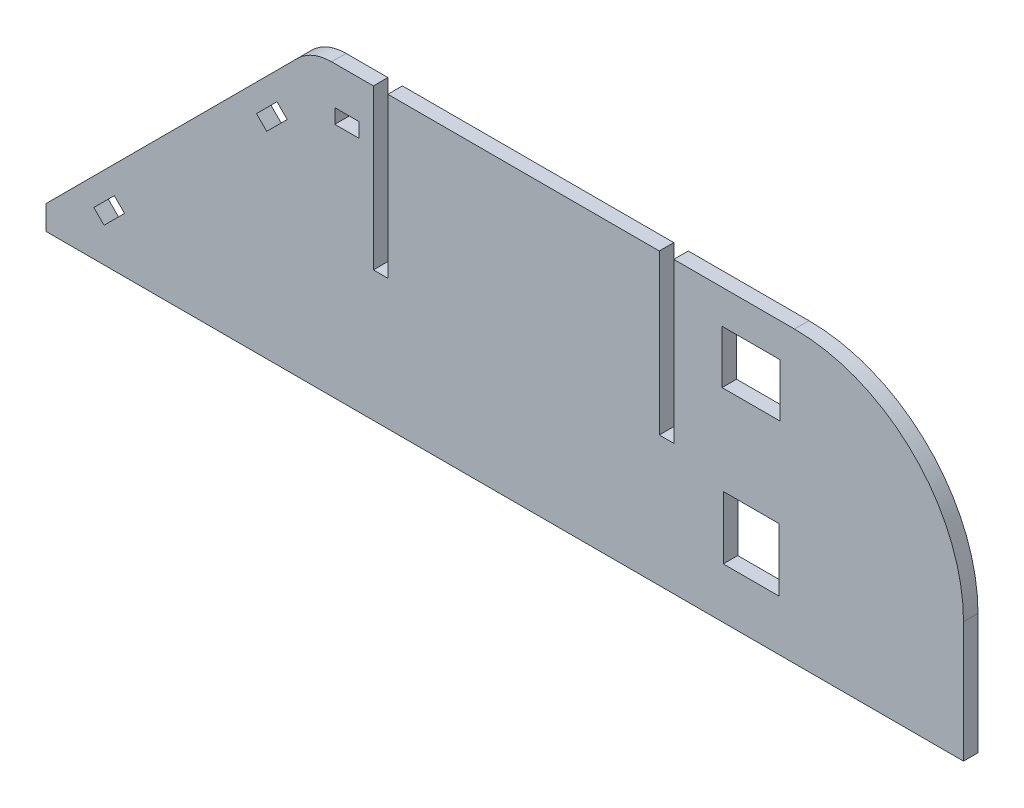
ISO-10303-21;
HEADER;
FILE_DESCRIPTION(('STEP AP214'),'2;1');
FILE_NAME('part.step','',(''),(''),'','','');
FILE_SCHEMA(('AUTOMOTIVE_DESIGN { 1 0 10303 214 1 1 1 1 }'));
ENDSEC;
DATA;
#1=APPLICATION_CONTEXT('core data for automotive mechanical design processes');
#2=APPLICATION_PROTOCOL_DEFINITION('international standard','automotive_design',2000,#1);
#3=PRODUCT_CONTEXT('',#1,'mechanical');
#4=PRODUCT('Part','Part','',(#3));
#5=PRODUCT_RELATED_PRODUCT_CATEGORY('part','',(#4));
#6=PRODUCT_DEFINITION_FORMATION('','',#4);
#7=PRODUCT_DEFINITION_CONTEXT('part definition',#1,'design');
#8=PRODUCT_DEFINITION('design','',#6,#7);
#9=PRODUCT_DEFINITION_SHAPE('','',#8);
#10=(LENGTH_UNIT() NAMED_UNIT(*) SI_UNIT(.MILLI.,.METRE.));
#11=(NAMED_UNIT(*) PLANE_ANGLE_UNIT() SI_UNIT($,.RADIAN.));
#12=(NAMED_UNIT(*) SI_UNIT($,.STERADIAN.) SOLID_ANGLE_UNIT());
#13=UNCERTAINTY_MEASURE_WITH_UNIT(LENGTH_MEASURE(1.E-05),#10,'distance_accuracy_value','');
#14=(GEOMETRIC_REPRESENTATION_CONTEXT(3) GLOBAL_UNCERTAINTY_ASSIGNED_CONTEXT((#13)) GLOBAL_UNIT_ASSIGNED_CONTEXT((#10,
#11,#12)) REPRESENTATION_CONTEXT('',''));
#15=CARTESIAN_POINT('',(0.,0.,0.));
#16=DIRECTION('',(0.,0.,1.));
#17=DIRECTION('',(1.,0.,0.));
#18=AXIS2_PLACEMENT_3D('',#15,#16,#17);
#19=CARTESIAN_POINT('',(0.,30.,3.));
#20=DIRECTION('',(0.,1.,0.));
#21=DIRECTION('',(-1.,0.,0.));
#22=AXIS2_PLACEMENT_3D('',#19,#20,#21);
#23=PLANE('',#22);
#24=DIRECTION('',(1.,0.,0.));
#25=VECTOR('',#24,1.);
#26=CARTESIAN_POINT('',(0.,30.,0.));
#27=LINE('',#26,#25);
#28=CARTESIAN_POINT('',(-35.857864376269,30.,0.));
#29=VERTEX_POINT('',#28);
#30=CARTESIAN_POINT('',(-27.2,30.,0.));
#31=VERTEX_POINT('',#30);
#32=EDGE_CURVE('E496',#29,#31,#27,.T.);
#33=ORIENTED_EDGE('',*,*,#32,.F.);
#34=DIRECTION('',(0.,0.,-1.));
#35=VECTOR('',#34,1.);
#36=CARTESIAN_POINT('',(-35.857864376269,30.,3.));
#37=LINE('',#36,#35);
#38=CARTESIAN_POINT('',(-35.857864376269,30.,3.));
#39=VERTEX_POINT('',#38);
#40=EDGE_CURVE('E45',#29,#39,#37,.F.);
#41=ORIENTED_EDGE('',*,*,#40,.T.);
#42=DIRECTION('',(1.,0.,0.));
#43=VECTOR('',#42,1.);
#44=CARTESIAN_POINT('',(0.,30.,3.));
#45=LINE('',#44,#43);
#46=CARTESIAN_POINT('',(-27.2,30.,3.));
#47=VERTEX_POINT('',#46);
#48=EDGE_CURVE('E482',#39,#47,#45,.T.);
#49=ORIENTED_EDGE('',*,*,#48,.T.);
#50=DIRECTION('',(0.,0.,1.));
#51=VECTOR('',#50,1.);
#52=CARTESIAN_POINT('',(-27.2,30.,0.));
#53=LINE('',#52,#51);
#54=EDGE_CURVE('E445',#31,#47,#53,.T.);
#55=ORIENTED_EDGE('',*,*,#54,.F.);
#56=EDGE_LOOP('',(#33,#41,#49,#55));
#57=FACE_BOUND('',#56,.T.);
#58=ADVANCED_FACE('F37',(#57),#23,.T.);
#59=DIRECTION('',(0.,0.,1.));
#60=VECTOR('',#59,1.);
#61=CARTESIAN_POINT('',(35.,30.,0.));
#62=LINE('',#61,#60);
#63=CARTESIAN_POINT('',(35.,30.,0.));
#64=VERTEX_POINT('',#63);
#65=CARTESIAN_POINT('',(35.,30.,3.));
#66=VERTEX_POINT('',#65);
#67=EDGE_CURVE('E465',#64,#66,#62,.T.);
#68=ORIENTED_EDGE('',*,*,#67,.T.);
#69=CARTESIAN_POINT('',(60.,30.,3.));
#70=VERTEX_POINT('',#69);
#71=EDGE_CURVE('E486',#66,#70,#45,.T.);
#72=ORIENTED_EDGE('',*,*,#71,.T.);
#73=DIRECTION('',(0.,0.,-1.));
#74=VECTOR('',#73,1.);
#75=CARTESIAN_POINT('',(60.,30.,3.));
#76=LINE('',#75,#74);
#77=CARTESIAN_POINT('',(60.,30.,0.));
#78=VERTEX_POINT('',#77);
#79=EDGE_CURVE('E516',#70,#78,#76,.T.);
#80=ORIENTED_EDGE('',*,*,#79,.T.);
#81=EDGE_CURVE('E474',#64,#78,#27,.T.);
#82=ORIENTED_EDGE('',*,*,#81,.F.);
#83=EDGE_LOOP('',(#68,#72,#80,#82));
#84=FACE_BOUND('',#83,.T.);
#85=ADVANCED_FACE('F569',(#84),#23,.T.);
#86=DIRECTION('',(0.,0.,1.));
#87=VECTOR('',#86,1.);
#88=CARTESIAN_POINT('',(-24.2,30.,0.));
#89=LINE('',#88,#87);
#90=CARTESIAN_POINT('',(-24.2,30.,0.));
#91=VERTEX_POINT('',#90);
#92=CARTESIAN_POINT('',(-24.2,30.,3.));
#93=VERTEX_POINT('',#92);
#94=EDGE_CURVE('E449',#91,#93,#89,.T.);
#95=ORIENTED_EDGE('',*,*,#94,.T.);
#96=CARTESIAN_POINT('',(32.,30.,3.));
#97=VERTEX_POINT('',#96);
#98=EDGE_CURVE('E485',#93,#97,#45,.T.);
#99=ORIENTED_EDGE('',*,*,#98,.T.);
#100=DIRECTION('',(0.,0.,1.));
#101=VECTOR('',#100,1.);
#102=CARTESIAN_POINT('',(32.,30.,0.));
#103=LINE('',#102,#101);
#104=CARTESIAN_POINT('',(32.,30.,0.));
#105=VERTEX_POINT('',#104);
#106=EDGE_CURVE('E477',#105,#97,#103,.T.);
#107=ORIENTED_EDGE('',*,*,#106,.F.);
#108=EDGE_CURVE('E499',#91,#105,#27,.T.);
#109=ORIENTED_EDGE('',*,*,#108,.F.);
#110=EDGE_LOOP('',(#95,#99,#107,#109));
#111=FACE_BOUND('',#110,.T.);
#112=ADVANCED_FACE('F574',(#111),#23,.T.);
#113=CARTESIAN_POINT('',(-35.,35.,3.));
#114=DIRECTION('',(0.707106781186547,-0.707106781186547,0.));
#115=DIRECTION('',(0.707106781186548,0.707106781186548,0.));
#116=AXIS2_PLACEMENT_3D('',#113,#114,#115);
#117=PLANE('',#116);
#118=DIRECTION('',(-0.707106781186548,-0.707106781186548,0.));
#119=VECTOR('',#118,1.);
#120=CARTESIAN_POINT('',(-35.,35.,3.));
#121=LINE('',#120,#119);
#122=CARTESIAN_POINT('',(-42.9289321881345,27.0710678118655,3.));
#123=VERTEX_POINT('',#122);
#124=CARTESIAN_POINT('',(-95.,-25.,3.));
#125=VERTEX_POINT('',#124);
#126=EDGE_CURVE('E484',#123,#125,#121,.T.);
#127=ORIENTED_EDGE('',*,*,#126,.F.);
#128=DIRECTION('',(0.,0.,-1.));
#129=VECTOR('',#128,1.);
#130=CARTESIAN_POINT('',(-42.9289321881345,27.0710678118655,0.));
#131=LINE('',#130,#129);
#132=CARTESIAN_POINT('',(-42.9289321881345,27.0710678118655,0.));
#133=VERTEX_POINT('',#132);
#134=EDGE_CURVE('E526',#123,#133,#131,.T.);
#135=ORIENTED_EDGE('',*,*,#134,.T.);
#136=DIRECTION('',(-0.707106781186548,-0.707106781186548,0.));
#137=VECTOR('',#136,1.);
#138=CARTESIAN_POINT('',(-35.,35.,0.));
#139=LINE('',#138,#137);
#140=CARTESIAN_POINT('',(-95.,-25.,0.));
#141=VERTEX_POINT('',#140);
#142=EDGE_CURVE('E498',#133,#141,#139,.T.);
#143=ORIENTED_EDGE('',*,*,#142,.T.);
#144=DIRECTION('',(0.,0.,-1.));
#145=VECTOR('',#144,1.);
#146=CARTESIAN_POINT('',(-95.,-25.,3.));
#147=LINE('',#146,#145);
#148=EDGE_CURVE('E513',#125,#141,#147,.T.);
#149=ORIENTED_EDGE('',*,*,#148,.F.);
#150=EDGE_LOOP('',(#127,#135,#143,#149));
#151=FACE_BOUND('',#150,.T.);
#152=ADVANCED_FACE('F544',(#151),#117,.F.);
#153=CARTESIAN_POINT('',(-95.,0.,3.));
#154=DIRECTION('',(1.,0.,0.));
#155=DIRECTION('',(0.,0.,-1.));
#156=AXIS2_PLACEMENT_3D('',#153,#154,#155);
#157=PLANE('',#156);
#158=DIRECTION('',(0.,-1.,0.));
#159=VECTOR('',#158,1.);
#160=CARTESIAN_POINT('',(-95.,0.,0.));
#161=LINE('',#160,#159);
#162=CARTESIAN_POINT('',(-95.,-30.,0.));
#163=VERTEX_POINT('',#162);
#164=EDGE_CURVE('E501',#141,#163,#161,.T.);
#165=ORIENTED_EDGE('',*,*,#164,.T.);
#166=DIRECTION('',(0.,0.,-1.));
#167=VECTOR('',#166,1.);
#168=CARTESIAN_POINT('',(-95.,-30.,3.));
#169=LINE('',#168,#167);
#170=CARTESIAN_POINT('',(-95.,-30.,3.));
#171=VERTEX_POINT('',#170);
#172=EDGE_CURVE('E510',#171,#163,#169,.T.);
#173=ORIENTED_EDGE('',*,*,#172,.F.);
#174=DIRECTION('',(0.,-1.,0.));
#175=VECTOR('',#174,1.);
#176=CARTESIAN_POINT('',(-95.,0.,3.));
#177=LINE('',#176,#175);
#178=EDGE_CURVE('E488',#125,#171,#177,.T.);
#179=ORIENTED_EDGE('',*,*,#178,.F.);
#180=ORIENTED_EDGE('',*,*,#148,.T.);
#181=EDGE_LOOP('',(#165,#173,#179,#180));
#182=FACE_BOUND('',#181,.T.);
#183=ADVANCED_FACE('F552',(#182),#157,.F.);
#184=CARTESIAN_POINT('',(0.,-30.,3.));
#185=DIRECTION('',(0.,1.,0.));
#186=DIRECTION('',(-1.,0.,0.));
#187=AXIS2_PLACEMENT_3D('',#184,#185,#186);
#188=PLANE('',#187);
#189=DIRECTION('',(1.,0.,0.));
#190=VECTOR('',#189,1.);
#191=CARTESIAN_POINT('',(0.,-30.,0.));
#192=LINE('',#191,#190);
#193=CARTESIAN_POINT('',(95.,-30.,0.));
#194=VERTEX_POINT('',#193);
#195=EDGE_CURVE('E503',#163,#194,#192,.T.);
#196=ORIENTED_EDGE('',*,*,#195,.T.);
#197=DIRECTION('',(0.,0.,-1.));
#198=VECTOR('',#197,1.);
#199=CARTESIAN_POINT('',(95.,-30.,3.));
#200=LINE('',#199,#198);
#201=CARTESIAN_POINT('',(95.,-30.,3.));
#202=VERTEX_POINT('',#201);
#203=EDGE_CURVE('E495',#202,#194,#200,.T.);
#204=ORIENTED_EDGE('',*,*,#203,.F.);
#205=DIRECTION('',(1.,0.,0.));
#206=VECTOR('',#205,1.);
#207=CARTESIAN_POINT('',(0.,-30.,3.));
#208=LINE('',#207,#206);
#209=EDGE_CURVE('E490',#171,#202,#208,.T.);
#210=ORIENTED_EDGE('',*,*,#209,.F.);
#211=ORIENTED_EDGE('',*,*,#172,.T.);
#212=EDGE_LOOP('',(#196,#204,#210,#211));
#213=FACE_BOUND('',#212,.T.);
#214=ADVANCED_FACE('F556',(#213),#188,.F.);
#215=CARTESIAN_POINT('',(95.,0.,3.));
#216=DIRECTION('',(1.,0.,0.));
#217=DIRECTION('',(0.,1.,0.));
#218=AXIS2_PLACEMENT_3D('',#215,#216,#217);
#219=PLANE('',#218);
#220=DIRECTION('',(0.,-1.,0.));
#221=VECTOR('',#220,1.);
#222=CARTESIAN_POINT('',(95.,0.,0.));
#223=LINE('',#222,#221);
#224=CARTESIAN_POINT('',(95.,-4.99999999999998,0.));
#225=VERTEX_POINT('',#224);
#226=EDGE_CURVE('E506',#225,#194,#223,.T.);
#227=ORIENTED_EDGE('',*,*,#226,.F.);
#228=DIRECTION('',(0.,0.,-1.));
#229=VECTOR('',#228,1.);
#230=CARTESIAN_POINT('',(95.,-4.99999999999998,3.));
#231=LINE('',#230,#229);
#232=CARTESIAN_POINT('',(95.,-4.99999999999998,3.));
#233=VERTEX_POINT('',#232);
#234=EDGE_CURVE('E521',#225,#233,#231,.F.);
#235=ORIENTED_EDGE('',*,*,#234,.T.);
#236=DIRECTION('',(0.,-1.,0.));
#237=VECTOR('',#236,1.);
#238=CARTESIAN_POINT('',(95.,0.,3.));
#239=LINE('',#238,#237);
#240=EDGE_CURVE('E493',#233,#202,#239,.T.);
#241=ORIENTED_EDGE('',*,*,#240,.T.);
#242=ORIENTED_EDGE('',*,*,#203,.T.);
#243=EDGE_LOOP('',(#227,#235,#241,#242));
#244=FACE_BOUND('',#243,.T.);
#245=ADVANCED_FACE('F618',(#244),#219,.T.);
#246=CARTESIAN_POINT('',(0.,0.,3.));
#247=DIRECTION('',(0.,0.,1.));
#248=DIRECTION('',(1.,0.,0.));
#249=AXIS2_PLACEMENT_3D('',#246,#247,#248);
#250=PLANE('',#249);
#251=DIRECTION('',(0.,-1.,0.));
#252=VECTOR('',#251,1.);
#253=CARTESIAN_POINT('',(-30.2,22.11,3.));
#254=LINE('',#253,#252);
#255=CARTESIAN_POINT('',(-30.2,22.11,3.));
#256=VERTEX_POINT('',#255);
#257=CARTESIAN_POINT('',(-30.2,19.11,3.));
#258=VERTEX_POINT('',#257);
#259=EDGE_CURVE('E265',#256,#258,#254,.T.);
#260=ORIENTED_EDGE('',*,*,#259,.T.);
#261=DIRECTION('',(-1.,0.,0.));
#262=VECTOR('',#261,1.);
#263=CARTESIAN_POINT('',(-30.2,19.11,3.));
#264=LINE('',#263,#262);
#265=CARTESIAN_POINT('',(-35.2,19.11,3.));
#266=VERTEX_POINT('',#265);
#267=EDGE_CURVE('E274',#258,#266,#264,.T.);
#268=ORIENTED_EDGE('',*,*,#267,.T.);
#269=DIRECTION('',(0.,1.,0.));
#270=VECTOR('',#269,1.);
#271=CARTESIAN_POINT('',(-35.2,22.11,3.));
#272=LINE('',#271,#270);
#273=CARTESIAN_POINT('',(-35.2,22.11,3.));
#274=VERTEX_POINT('',#273);
#275=EDGE_CURVE('E52',#266,#274,#272,.T.);
#276=ORIENTED_EDGE('',*,*,#275,.T.);
#277=DIRECTION('',(1.,0.,0.));
#278=VECTOR('',#277,1.);
#279=CARTESIAN_POINT('',(-30.2,22.11,3.));
#280=LINE('',#279,#278);
#281=EDGE_CURVE('E271',#274,#256,#280,.T.);
#282=ORIENTED_EDGE('',*,*,#281,.T.);
#283=EDGE_LOOP('',(#260,#268,#276,#282));
#284=FACE_BOUND('',#283,.T.);
#285=DIRECTION('',(0.707106781186548,0.707106781186548,0.));
#286=VECTOR('',#285,1.);
#287=CARTESIAN_POINT('',(-80.8578643762691,-16.5147186257614,3.));
#288=LINE('',#287,#286);
#289=CARTESIAN_POINT('',(-85.1005050633884,-20.7573593128807,3.));
#290=VERTEX_POINT('',#289);
#291=CARTESIAN_POINT('',(-80.8578643762691,-16.5147186257614,3.));
#292=VERTEX_POINT('',#291);
#293=EDGE_CURVE('E300',#290,#292,#288,.T.);
#294=ORIENTED_EDGE('',*,*,#293,.T.);
#295=DIRECTION('',(0.707106781186551,-0.707106781186544,0.));
#296=VECTOR('',#295,1.);
#297=CARTESIAN_POINT('',(-78.7365440327094,-18.6360389693211,3.));
#298=LINE('',#297,#296);
#299=CARTESIAN_POINT('',(-78.7365440327094,-18.6360389693211,3.));
#300=VERTEX_POINT('',#299);
#301=EDGE_CURVE('E303',#292,#300,#298,.T.);
#302=ORIENTED_EDGE('',*,*,#301,.T.);
#303=DIRECTION('',(-0.707106781186548,-0.707106781186547,0.));
#304=VECTOR('',#303,1.);
#305=CARTESIAN_POINT('',(-82.9791847198287,-22.8786796564404,3.));
#306=LINE('',#305,#304);
#307=CARTESIAN_POINT('',(-82.9791847198287,-22.8786796564404,3.));
#308=VERTEX_POINT('',#307);
#309=EDGE_CURVE('E307',#300,#308,#306,.T.);
#310=ORIENTED_EDGE('',*,*,#309,.T.);
#311=DIRECTION('',(-0.707106781186547,0.707106781186547,0.));
#312=VECTOR('',#311,1.);
#313=CARTESIAN_POINT('',(-85.1005050633884,-20.7573593128807,3.));
#314=LINE('',#313,#312);
#315=EDGE_CURVE('E310',#308,#290,#314,.T.);
#316=ORIENTED_EDGE('',*,*,#315,.T.);
#317=EDGE_LOOP('',(#294,#302,#310,#316));
#318=FACE_BOUND('',#317,.T.);
#319=DIRECTION('',(0.707106781186548,0.707106781186548,0.));
#320=VECTOR('',#319,1.);
#321=CARTESIAN_POINT('',(-51.4142135623731,12.9289321881345,3.));
#322=LINE('',#321,#320);
#323=CARTESIAN_POINT('',(-51.4142135623731,12.9289321881345,3.));
#324=VERTEX_POINT('',#323);
#325=CARTESIAN_POINT('',(-47.1715728752538,17.1715728752538,3.));
#326=VERTEX_POINT('',#325);
#327=EDGE_CURVE('E332',#324,#326,#322,.T.);
#328=ORIENTED_EDGE('',*,*,#327,.T.);
#329=DIRECTION('',(0.707106781186548,-0.707106781186547,0.));
#330=VECTOR('',#329,1.);
#331=CARTESIAN_POINT('',(-47.1715728752538,17.1715728752538,3.));
#332=LINE('',#331,#330);
#333=CARTESIAN_POINT('',(-45.0502525316942,15.0502525316942,3.));
#334=VERTEX_POINT('',#333);
#335=EDGE_CURVE('E335',#326,#334,#332,.T.);
#336=ORIENTED_EDGE('',*,*,#335,.T.);
#337=DIRECTION('',(-0.707106781186547,-0.707106781186548,0.));
#338=VECTOR('',#337,1.);
#339=CARTESIAN_POINT('',(-45.0502525316942,15.0502525316942,3.));
#340=LINE('',#339,#338);
#341=CARTESIAN_POINT('',(-49.2928932188135,10.8076118445749,3.));
#342=VERTEX_POINT('',#341);
#343=EDGE_CURVE('E339',#334,#342,#340,.T.);
#344=ORIENTED_EDGE('',*,*,#343,.T.);
#345=DIRECTION('',(-0.707106781186548,0.707106781186548,0.));
#346=VECTOR('',#345,1.);
#347=CARTESIAN_POINT('',(-49.2928932188135,10.8076118445749,3.));
#348=LINE('',#347,#346);
#349=EDGE_CURVE('E342',#342,#324,#348,.T.);
#350=ORIENTED_EDGE('',*,*,#349,.T.);
#351=EDGE_LOOP('',(#328,#336,#344,#350));
#352=FACE_BOUND('',#351,.T.);
#353=DIRECTION('',(0.,1.,0.));
#354=VECTOR('',#353,1.);
#355=CARTESIAN_POINT('',(45.,23.,3.));
#356=LINE('',#355,#354);
#357=CARTESIAN_POINT('',(45.,12.,3.));
#358=VERTEX_POINT('',#357);
#359=CARTESIAN_POINT('',(45.,23.,3.));
#360=VERTEX_POINT('',#359);
#361=EDGE_CURVE('E364',#358,#360,#356,.T.);
#362=ORIENTED_EDGE('',*,*,#361,.T.);
#363=DIRECTION('',(1.,0.,0.));
#364=VECTOR('',#363,1.);
#365=CARTESIAN_POINT('',(57.,23.,3.));
#366=LINE('',#365,#364);
#367=CARTESIAN_POINT('',(57.,23.,3.));
#368=VERTEX_POINT('',#367);
#369=EDGE_CURVE('E367',#360,#368,#366,.T.);
#370=ORIENTED_EDGE('',*,*,#369,.T.);
#371=DIRECTION('',(0.,-1.,0.));
#372=VECTOR('',#371,1.);
#373=CARTESIAN_POINT('',(57.,23.,3.));
#374=LINE('',#373,#372);
#375=CARTESIAN_POINT('',(57.,12.,3.));
#376=VERTEX_POINT('',#375);
#377=EDGE_CURVE('E371',#368,#376,#374,.T.);
#378=ORIENTED_EDGE('',*,*,#377,.T.);
#379=DIRECTION('',(-1.,0.,0.));
#380=VECTOR('',#379,1.);
#381=CARTESIAN_POINT('',(57.,12.,3.));
#382=LINE('',#381,#380);
#383=EDGE_CURVE('E374',#376,#358,#382,.T.);
#384=ORIENTED_EDGE('',*,*,#383,.T.);
#385=EDGE_LOOP('',(#362,#370,#378,#384));
#386=FACE_BOUND('',#385,.T.);
#387=DIRECTION('',(0.,1.,0.));
#388=VECTOR('',#387,1.);
#389=CARTESIAN_POINT('',(45.25,-6.5,3.));
#390=LINE('',#389,#388);
#391=CARTESIAN_POINT('',(45.25,-19.5,3.));
#392=VERTEX_POINT('',#391);
#393=CARTESIAN_POINT('',(45.25,-6.5,3.));
#394=VERTEX_POINT('',#393);
#395=EDGE_CURVE('E396',#392,#394,#390,.T.);
#396=ORIENTED_EDGE('',*,*,#395,.T.);
#397=DIRECTION('',(1.,0.,0.));
#398=VECTOR('',#397,1.);
#399=CARTESIAN_POINT('',(56.75,-6.5,3.));
#400=LINE('',#399,#398);
#401=CARTESIAN_POINT('',(56.75,-6.5,3.));
#402=VERTEX_POINT('',#401);
#403=EDGE_CURVE('E399',#394,#402,#400,.T.);
#404=ORIENTED_EDGE('',*,*,#403,.T.);
#405=DIRECTION('',(0.,-1.,0.));
#406=VECTOR('',#405,1.);
#407=CARTESIAN_POINT('',(56.75,-6.5,3.));
#408=LINE('',#407,#406);
#409=CARTESIAN_POINT('',(56.75,-19.5,3.));
#410=VERTEX_POINT('',#409);
#411=EDGE_CURVE('E403',#402,#410,#408,.T.);
#412=ORIENTED_EDGE('',*,*,#411,.T.);
#413=DIRECTION('',(-1.,0.,0.));
#414=VECTOR('',#413,1.);
#415=CARTESIAN_POINT('',(56.75,-19.5,3.));
#416=LINE('',#415,#414);
#417=EDGE_CURVE('E406',#410,#392,#416,.T.);
#418=ORIENTED_EDGE('',*,*,#417,.T.);
#419=EDGE_LOOP('',(#396,#404,#412,#418));
#420=FACE_BOUND('',#419,.T.);
#421=ORIENTED_EDGE('',*,*,#48,.F.);
#422=CARTESIAN_POINT('',(-35.857864376269,20.,3.));
#423=DIRECTION('',(0.,0.,1.));
#424=DIRECTION('',(1.,0.,0.));
#425=AXIS2_PLACEMENT_3D('',#422,#423,#424);
#426=CIRCLE('',#425,10.);
#427=EDGE_CURVE('E11',#39,#123,#426,.T.);
#428=ORIENTED_EDGE('',*,*,#427,.T.);
#429=ORIENTED_EDGE('',*,*,#126,.T.);
#430=ORIENTED_EDGE('',*,*,#178,.T.);
#431=ORIENTED_EDGE('',*,*,#209,.T.);
#432=ORIENTED_EDGE('',*,*,#240,.F.);
#433=CARTESIAN_POINT('',(60.,-4.99999999999999,3.));
#434=DIRECTION('',(0.,0.,1.));
#435=DIRECTION('',(1.,0.,0.));
#436=AXIS2_PLACEMENT_3D('',#433,#434,#435);
#437=CIRCLE('',#436,35.);
#438=EDGE_CURVE('E523',#233,#70,#437,.T.);
#439=ORIENTED_EDGE('',*,*,#438,.T.);
#440=ORIENTED_EDGE('',*,*,#71,.F.);
#441=DIRECTION('',(0.,1.,0.));
#442=VECTOR('',#441,1.);
#443=CARTESIAN_POINT('',(35.,30.,3.));
#444=LINE('',#443,#442);
#445=CARTESIAN_POINT('',(35.,-2.99999999999999,3.));
#446=VERTEX_POINT('',#445);
#447=EDGE_CURVE('E448',#446,#66,#444,.T.);
#448=ORIENTED_EDGE('',*,*,#447,.F.);
#449=DIRECTION('',(1.,0.,0.));
#450=VECTOR('',#449,1.);
#451=CARTESIAN_POINT('',(35.,-2.99999999999999,3.));
#452=LINE('',#451,#450);
#453=CARTESIAN_POINT('',(32.,-2.99999999999999,3.));
#454=VERTEX_POINT('',#453);
#455=EDGE_CURVE('E459',#454,#446,#452,.T.);
#456=ORIENTED_EDGE('',*,*,#455,.F.);
#457=DIRECTION('',(0.,-1.,0.));
#458=VECTOR('',#457,1.);
#459=CARTESIAN_POINT('',(32.,30.,3.));
#460=LINE('',#459,#458);
#461=EDGE_CURVE('E467',#97,#454,#460,.T.);
#462=ORIENTED_EDGE('',*,*,#461,.F.);
#463=ORIENTED_EDGE('',*,*,#98,.F.);
#464=DIRECTION('',(0.,1.,0.));
#465=VECTOR('',#464,1.);
#466=CARTESIAN_POINT('',(-24.2,30.,3.));
#467=LINE('',#466,#465);
#468=CARTESIAN_POINT('',(-24.2,-3.,3.));
#469=VERTEX_POINT('',#468);
#470=EDGE_CURVE('E432',#469,#93,#467,.T.);
#471=ORIENTED_EDGE('',*,*,#470,.F.);
#472=DIRECTION('',(1.,0.,0.));
#473=VECTOR('',#472,1.);
#474=CARTESIAN_POINT('',(-27.2,-3.,3.));
#475=LINE('',#474,#473);
#476=CARTESIAN_POINT('',(-27.2,-3.,3.));
#477=VERTEX_POINT('',#476);
#478=EDGE_CURVE('E441',#477,#469,#475,.T.);
#479=ORIENTED_EDGE('',*,*,#478,.F.);
#480=DIRECTION('',(0.,-1.,0.));
#481=VECTOR('',#480,1.);
#482=CARTESIAN_POINT('',(-27.2,30.,3.));
#483=LINE('',#482,#481);
#484=EDGE_CURVE('E421',#47,#477,#483,.T.);
#485=ORIENTED_EDGE('',*,*,#484,.F.);
#486=EDGE_LOOP('',(#421,#428,#429,#430,#431,#432,#439,#440,#448,#456,#462,#463,#471,#479,#485));
#487=FACE_BOUND('',#486,.T.);
#488=ADVANCED_FACE('F278',(#284,#318,#352,#386,#420,#487),#250,.T.);
#489=CARTESIAN_POINT('',(0.,0.,0.));
#490=DIRECTION('',(0.,0.,1.));
#491=DIRECTION('',(1.,0.,0.));
#492=AXIS2_PLACEMENT_3D('',#489,#490,#491);
#493=PLANE('',#492);
#494=DIRECTION('',(-1.,0.,0.));
#495=VECTOR('',#494,1.);
#496=CARTESIAN_POINT('',(-30.2,19.11,0.));
#497=LINE('',#496,#495);
#498=CARTESIAN_POINT('',(-30.2,19.11,0.));
#499=VERTEX_POINT('',#498);
#500=CARTESIAN_POINT('',(-35.2,19.11,0.));
#501=VERTEX_POINT('',#500);
#502=EDGE_CURVE('E290',#499,#501,#497,.T.);
#503=ORIENTED_EDGE('',*,*,#502,.F.);
#504=DIRECTION('',(0.,-1.,0.));
#505=VECTOR('',#504,1.);
#506=CARTESIAN_POINT('',(-30.2,22.11,0.));
#507=LINE('',#506,#505);
#508=CARTESIAN_POINT('',(-30.2,22.11,0.));
#509=VERTEX_POINT('',#508);
#510=EDGE_CURVE('E60',#509,#499,#507,.T.);
#511=ORIENTED_EDGE('',*,*,#510,.F.);
#512=DIRECTION('',(1.,0.,0.));
#513=VECTOR('',#512,1.);
#514=CARTESIAN_POINT('',(-30.2,22.11,0.));
#515=LINE('',#514,#513);
#516=CARTESIAN_POINT('',(-35.2,22.11,0.));
#517=VERTEX_POINT('',#516);
#518=EDGE_CURVE('E281',#517,#509,#515,.T.);
#519=ORIENTED_EDGE('',*,*,#518,.F.);
#520=DIRECTION('',(0.,1.,0.));
#521=VECTOR('',#520,1.);
#522=CARTESIAN_POINT('',(-35.2,22.11,0.));
#523=LINE('',#522,#521);
#524=EDGE_CURVE('E284',#501,#517,#523,.T.);
#525=ORIENTED_EDGE('',*,*,#524,.F.);
#526=EDGE_LOOP('',(#503,#511,#519,#525));
#527=FACE_BOUND('',#526,.T.);
#528=DIRECTION('',(0.707106781186551,-0.707106781186544,0.));
#529=VECTOR('',#528,1.);
#530=CARTESIAN_POINT('',(-78.7365440327094,-18.6360389693211,0.));
#531=LINE('',#530,#529);
#532=CARTESIAN_POINT('',(-80.8578643762691,-16.5147186257615,0.));
#533=VERTEX_POINT('',#532);
#534=CARTESIAN_POINT('',(-78.7365440327094,-18.6360389693211,0.));
#535=VERTEX_POINT('',#534);
#536=EDGE_CURVE('E315',#533,#535,#531,.T.);
#537=ORIENTED_EDGE('',*,*,#536,.F.);
#538=DIRECTION('',(0.707106781186548,0.707106781186548,0.));
#539=VECTOR('',#538,1.);
#540=CARTESIAN_POINT('',(-80.8578643762691,-16.5147186257614,0.));
#541=LINE('',#540,#539);
#542=CARTESIAN_POINT('',(-85.1005050633884,-20.7573593128807,0.));
#543=VERTEX_POINT('',#542);
#544=EDGE_CURVE('E296',#543,#533,#541,.T.);
#545=ORIENTED_EDGE('',*,*,#544,.F.);
#546=DIRECTION('',(-0.707106781186547,0.707106781186547,0.));
#547=VECTOR('',#546,1.);
#548=CARTESIAN_POINT('',(-85.1005050633884,-20.7573593128807,0.));
#549=LINE('',#548,#547);
#550=CARTESIAN_POINT('',(-82.9791847198287,-22.8786796564404,0.));
#551=VERTEX_POINT('',#550);
#552=EDGE_CURVE('E304',#551,#543,#549,.T.);
#553=ORIENTED_EDGE('',*,*,#552,.F.);
#554=DIRECTION('',(-0.707106781186548,-0.707106781186547,0.));
#555=VECTOR('',#554,1.);
#556=CARTESIAN_POINT('',(-82.9791847198287,-22.8786796564404,0.));
#557=LINE('',#556,#555);
#558=EDGE_CURVE('E318',#535,#551,#557,.T.);
#559=ORIENTED_EDGE('',*,*,#558,.F.);
#560=EDGE_LOOP('',(#537,#545,#553,#559));
#561=FACE_BOUND('',#560,.T.);
#562=DIRECTION('',(0.707106781186548,-0.707106781186547,0.));
#563=VECTOR('',#562,1.);
#564=CARTESIAN_POINT('',(-47.1715728752538,17.1715728752538,0.));
#565=LINE('',#564,#563);
#566=CARTESIAN_POINT('',(-47.1715728752538,17.1715728752538,0.));
#567=VERTEX_POINT('',#566);
#568=CARTESIAN_POINT('',(-45.0502525316942,15.0502525316942,0.));
#569=VERTEX_POINT('',#568);
#570=EDGE_CURVE('E347',#567,#569,#565,.T.);
#571=ORIENTED_EDGE('',*,*,#570,.F.);
#572=DIRECTION('',(0.707106781186548,0.707106781186548,0.));
#573=VECTOR('',#572,1.);
#574=CARTESIAN_POINT('',(-51.4142135623731,12.9289321881345,0.));
#575=LINE('',#574,#573);
#576=CARTESIAN_POINT('',(-51.4142135623731,12.9289321881345,0.));
#577=VERTEX_POINT('',#576);
#578=EDGE_CURVE('E325',#577,#567,#575,.T.);
#579=ORIENTED_EDGE('',*,*,#578,.F.);
#580=DIRECTION('',(-0.707106781186548,0.707106781186548,0.));
#581=VECTOR('',#580,1.);
#582=CARTESIAN_POINT('',(-49.2928932188135,10.8076118445749,0.));
#583=LINE('',#582,#581);
#584=CARTESIAN_POINT('',(-49.2928932188135,10.8076118445749,0.));
#585=VERTEX_POINT('',#584);
#586=EDGE_CURVE('E336',#585,#577,#583,.T.);
#587=ORIENTED_EDGE('',*,*,#586,.F.);
#588=DIRECTION('',(-0.707106781186547,-0.707106781186548,0.));
#589=VECTOR('',#588,1.);
#590=CARTESIAN_POINT('',(-45.0502525316942,15.0502525316942,0.));
#591=LINE('',#590,#589);
#592=EDGE_CURVE('E350',#569,#585,#591,.T.);
#593=ORIENTED_EDGE('',*,*,#592,.F.);
#594=EDGE_LOOP('',(#571,#579,#587,#593));
#595=FACE_BOUND('',#594,.T.);
#596=DIRECTION('',(1.,0.,0.));
#597=VECTOR('',#596,1.);
#598=CARTESIAN_POINT('',(57.,23.,0.));
#599=LINE('',#598,#597);
#600=CARTESIAN_POINT('',(45.,23.,0.));
#601=VERTEX_POINT('',#600);
#602=CARTESIAN_POINT('',(57.,23.,0.));
#603=VERTEX_POINT('',#602);
#604=EDGE_CURVE('E379',#601,#603,#599,.T.);
#605=ORIENTED_EDGE('',*,*,#604,.F.);
#606=DIRECTION('',(0.,1.,0.));
#607=VECTOR('',#606,1.);
#608=CARTESIAN_POINT('',(45.,23.,0.));
#609=LINE('',#608,#607);
#610=CARTESIAN_POINT('',(45.,12.,0.));
#611=VERTEX_POINT('',#610);
#612=EDGE_CURVE('E357',#611,#601,#609,.T.);
#613=ORIENTED_EDGE('',*,*,#612,.F.);
#614=DIRECTION('',(-1.,0.,0.));
#615=VECTOR('',#614,1.);
#616=CARTESIAN_POINT('',(57.,12.,0.));
#617=LINE('',#616,#615);
#618=CARTESIAN_POINT('',(57.,12.,0.));
#619=VERTEX_POINT('',#618);
#620=EDGE_CURVE('E368',#619,#611,#617,.T.);
#621=ORIENTED_EDGE('',*,*,#620,.F.);
#622=DIRECTION('',(0.,-1.,0.));
#623=VECTOR('',#622,1.);
#624=CARTESIAN_POINT('',(57.,23.,0.));
#625=LINE('',#624,#623);
#626=EDGE_CURVE('E382',#603,#619,#625,.T.);
#627=ORIENTED_EDGE('',*,*,#626,.F.);
#628=EDGE_LOOP('',(#605,#613,#621,#627));
#629=FACE_BOUND('',#628,.T.);
#630=DIRECTION('',(1.,0.,0.));
#631=VECTOR('',#630,1.);
#632=CARTESIAN_POINT('',(56.75,-6.5,0.));
#633=LINE('',#632,#631);
#634=CARTESIAN_POINT('',(45.25,-6.5,0.));
#635=VERTEX_POINT('',#634);
#636=CARTESIAN_POINT('',(56.75,-6.5,0.));
#637=VERTEX_POINT('',#636);
#638=EDGE_CURVE('E411',#635,#637,#633,.T.);
#639=ORIENTED_EDGE('',*,*,#638,.F.);
#640=DIRECTION('',(0.,1.,0.));
#641=VECTOR('',#640,1.);
#642=CARTESIAN_POINT('',(45.25,-6.5,0.));
#643=LINE('',#642,#641);
#644=CARTESIAN_POINT('',(45.25,-19.5,0.));
#645=VERTEX_POINT('',#644);
#646=EDGE_CURVE('E389',#645,#635,#643,.T.);
#647=ORIENTED_EDGE('',*,*,#646,.F.);
#648=DIRECTION('',(-1.,0.,0.));
#649=VECTOR('',#648,1.);
#650=CARTESIAN_POINT('',(56.75,-19.5,0.));
#651=LINE('',#650,#649);
#652=CARTESIAN_POINT('',(56.75,-19.5,0.));
#653=VERTEX_POINT('',#652);
#654=EDGE_CURVE('E400',#653,#645,#651,.T.);
#655=ORIENTED_EDGE('',*,*,#654,.F.);
#656=DIRECTION('',(0.,-1.,0.));
#657=VECTOR('',#656,1.);
#658=CARTESIAN_POINT('',(56.75,-6.5,0.));
#659=LINE('',#658,#657);
#660=EDGE_CURVE('E414',#637,#653,#659,.T.);
#661=ORIENTED_EDGE('',*,*,#660,.F.);
#662=EDGE_LOOP('',(#639,#647,#655,#661));
#663=FACE_BOUND('',#662,.T.);
#664=ORIENTED_EDGE('',*,*,#142,.F.);
#665=CARTESIAN_POINT('',(-35.857864376269,20.,0.));
#666=DIRECTION('',(0.,0.,1.));
#667=DIRECTION('',(1.,0.,0.));
#668=AXIS2_PLACEMENT_3D('',#665,#666,#667);
#669=CIRCLE('',#668,10.);
#670=EDGE_CURVE('E529',#133,#29,#669,.F.);
#671=ORIENTED_EDGE('',*,*,#670,.T.);
#672=ORIENTED_EDGE('',*,*,#32,.T.);
#673=DIRECTION('',(0.,-1.,0.));
#674=VECTOR('',#673,1.);
#675=CARTESIAN_POINT('',(-27.2,30.,0.));
#676=LINE('',#675,#674);
#677=CARTESIAN_POINT('',(-27.2,-3.,0.));
#678=VERTEX_POINT('',#677);
#679=EDGE_CURVE('E428',#31,#678,#676,.T.);
#680=ORIENTED_EDGE('',*,*,#679,.T.);
#681=DIRECTION('',(1.,0.,0.));
#682=VECTOR('',#681,1.);
#683=CARTESIAN_POINT('',(-27.2,-3.,0.));
#684=LINE('',#683,#682);
#685=CARTESIAN_POINT('',(-24.2,-3.,0.));
#686=VERTEX_POINT('',#685);
#687=EDGE_CURVE('E431',#678,#686,#684,.T.);
#688=ORIENTED_EDGE('',*,*,#687,.T.);
#689=DIRECTION('',(0.,1.,0.));
#690=VECTOR('',#689,1.);
#691=CARTESIAN_POINT('',(-24.2,30.,0.));
#692=LINE('',#691,#690);
#693=EDGE_CURVE('E435',#686,#91,#692,.T.);
#694=ORIENTED_EDGE('',*,*,#693,.T.);
#695=ORIENTED_EDGE('',*,*,#108,.T.);
#696=DIRECTION('',(0.,-1.,0.));
#697=VECTOR('',#696,1.);
#698=CARTESIAN_POINT('',(32.,30.,0.));
#699=LINE('',#698,#697);
#700=CARTESIAN_POINT('',(32.,-2.99999999999999,0.));
#701=VERTEX_POINT('',#700);
#702=EDGE_CURVE('E458',#105,#701,#699,.T.);
#703=ORIENTED_EDGE('',*,*,#702,.T.);
#704=DIRECTION('',(1.,0.,0.));
#705=VECTOR('',#704,1.);
#706=CARTESIAN_POINT('',(35.,-2.99999999999999,0.));
#707=LINE('',#706,#705);
#708=CARTESIAN_POINT('',(35.,-2.99999999999999,0.));
#709=VERTEX_POINT('',#708);
#710=EDGE_CURVE('E462',#701,#709,#707,.T.);
#711=ORIENTED_EDGE('',*,*,#710,.T.);
#712=DIRECTION('',(0.,1.,0.));
#713=VECTOR('',#712,1.);
#714=CARTESIAN_POINT('',(35.,30.,0.));
#715=LINE('',#714,#713);
#716=EDGE_CURVE('E455',#709,#64,#715,.T.);
#717=ORIENTED_EDGE('',*,*,#716,.T.);
#718=ORIENTED_EDGE('',*,*,#81,.T.);
#719=CARTESIAN_POINT('',(60.,-4.99999999999999,0.));
#720=DIRECTION('',(0.,0.,1.));
#721=DIRECTION('',(1.,0.,0.));
#722=AXIS2_PLACEMENT_3D('',#719,#720,#721);
#723=CIRCLE('',#722,35.);
#724=EDGE_CURVE('E519',#78,#225,#723,.F.);
#725=ORIENTED_EDGE('',*,*,#724,.T.);
#726=ORIENTED_EDGE('',*,*,#226,.T.);
#727=ORIENTED_EDGE('',*,*,#195,.F.);
#728=ORIENTED_EDGE('',*,*,#164,.F.);
#729=EDGE_LOOP('',(#664,#671,#672,#680,#688,#694,#695,#703,#711,#717,#718,#725,#726,#727,#728));
#730=FACE_BOUND('',#729,.T.);
#731=ADVANCED_FACE('F548',(#527,#561,#595,#629,#663,#730),#493,.F.);
#732=CARTESIAN_POINT('',(60.,-4.99999999999999,3.));
#733=DIRECTION('',(0.,0.,-1.));
#734=DIRECTION('',(-1.,0.,0.));
#735=AXIS2_PLACEMENT_3D('',#732,#733,#734);
#736=CYLINDRICAL_SURFACE('',#735,35.);
#737=ORIENTED_EDGE('',*,*,#438,.F.);
#738=ORIENTED_EDGE('',*,*,#234,.F.);
#739=ORIENTED_EDGE('',*,*,#724,.F.);
#740=ORIENTED_EDGE('',*,*,#79,.F.);
#741=EDGE_LOOP('',(#737,#738,#739,#740));
#742=FACE_BOUND('',#741,.T.);
#743=ADVANCED_FACE('F565',(#742),#736,.T.);
#744=CARTESIAN_POINT('',(35.,30.,0.));
#745=DIRECTION('',(1.,0.,0.));
#746=DIRECTION('',(0.,0.,-1.));
#747=AXIS2_PLACEMENT_3D('',#744,#745,#746);
#748=PLANE('',#747);
#749=ORIENTED_EDGE('',*,*,#447,.T.);
#750=ORIENTED_EDGE('',*,*,#67,.F.);
#751=ORIENTED_EDGE('',*,*,#716,.F.);
#752=DIRECTION('',(0.,0.,1.));
#753=VECTOR('',#752,1.);
#754=CARTESIAN_POINT('',(35.,-2.99999999999999,0.));
#755=LINE('',#754,#753);
#756=EDGE_CURVE('E472',#709,#446,#755,.T.);
#757=ORIENTED_EDGE('',*,*,#756,.T.);
#758=EDGE_LOOP('',(#749,#750,#751,#757));
#759=FACE_BOUND('',#758,.T.);
#760=ADVANCED_FACE('F588',(#759),#748,.F.);
#761=CARTESIAN_POINT('',(35.,-2.99999999999999,0.));
#762=DIRECTION('',(0.,-1.,0.));
#763=DIRECTION('',(0.,0.,-1.));
#764=AXIS2_PLACEMENT_3D('',#761,#762,#763);
#765=PLANE('',#764);
#766=ORIENTED_EDGE('',*,*,#455,.T.);
#767=ORIENTED_EDGE('',*,*,#756,.F.);
#768=ORIENTED_EDGE('',*,*,#710,.F.);
#769=DIRECTION('',(0.,0.,1.));
#770=VECTOR('',#769,1.);
#771=CARTESIAN_POINT('',(32.,-2.99999999999999,0.));
#772=LINE('',#771,#770);
#773=EDGE_CURVE('E475',#701,#454,#772,.T.);
#774=ORIENTED_EDGE('',*,*,#773,.T.);
#775=EDGE_LOOP('',(#766,#767,#768,#774));
#776=FACE_BOUND('',#775,.T.);
#777=ADVANCED_FACE('F584',(#776),#765,.F.);
#778=CARTESIAN_POINT('',(32.,30.,0.));
#779=DIRECTION('',(-1.,0.,0.));
#780=DIRECTION('',(0.,-1.,0.));
#781=AXIS2_PLACEMENT_3D('',#778,#779,#780);
#782=PLANE('',#781);
#783=ORIENTED_EDGE('',*,*,#461,.T.);
#784=ORIENTED_EDGE('',*,*,#773,.F.);
#785=ORIENTED_EDGE('',*,*,#702,.F.);
#786=ORIENTED_EDGE('',*,*,#106,.T.);
#787=EDGE_LOOP('',(#783,#784,#785,#786));
#788=FACE_BOUND('',#787,.T.);
#789=ADVANCED_FACE('F580',(#788),#782,.F.);
#790=CARTESIAN_POINT('',(-27.2,30.,0.));
#791=DIRECTION('',(-1.,0.,0.));
#792=DIRECTION('',(0.,-1.,0.));
#793=AXIS2_PLACEMENT_3D('',#790,#791,#792);
#794=PLANE('',#793);
#795=ORIENTED_EDGE('',*,*,#484,.T.);
#796=DIRECTION('',(0.,0.,1.));
#797=VECTOR('',#796,1.);
#798=CARTESIAN_POINT('',(-27.2,-3.,0.));
#799=LINE('',#798,#797);
#800=EDGE_CURVE('E438',#678,#477,#799,.T.);
#801=ORIENTED_EDGE('',*,*,#800,.F.);
#802=ORIENTED_EDGE('',*,*,#679,.F.);
#803=ORIENTED_EDGE('',*,*,#54,.T.);
#804=EDGE_LOOP('',(#795,#801,#802,#803));
#805=FACE_BOUND('',#804,.T.);
#806=ADVANCED_FACE('F740',(#805),#794,.F.);
#807=CARTESIAN_POINT('',(-24.2,30.,0.));
#808=DIRECTION('',(1.,0.,0.));
#809=DIRECTION('',(0.,1.,0.));
#810=AXIS2_PLACEMENT_3D('',#807,#808,#809);
#811=PLANE('',#810);
#812=ORIENTED_EDGE('',*,*,#470,.T.);
#813=ORIENTED_EDGE('',*,*,#94,.F.);
#814=ORIENTED_EDGE('',*,*,#693,.F.);
#815=DIRECTION('',(0.,0.,1.));
#816=VECTOR('',#815,1.);
#817=CARTESIAN_POINT('',(-24.2,-3.,0.));
#818=LINE('',#817,#816);
#819=EDGE_CURVE('E452',#686,#469,#818,.T.);
#820=ORIENTED_EDGE('',*,*,#819,.T.);
#821=EDGE_LOOP('',(#812,#813,#814,#820));
#822=FACE_BOUND('',#821,.T.);
#823=ADVANCED_FACE('F737',(#822),#811,.F.);
#824=CARTESIAN_POINT('',(-27.2,-3.,0.));
#825=DIRECTION('',(0.,-1.,0.));
#826=DIRECTION('',(1.,0.,0.));
#827=AXIS2_PLACEMENT_3D('',#824,#825,#826);
#828=PLANE('',#827);
#829=ORIENTED_EDGE('',*,*,#478,.T.);
#830=ORIENTED_EDGE('',*,*,#819,.F.);
#831=ORIENTED_EDGE('',*,*,#687,.F.);
#832=ORIENTED_EDGE('',*,*,#800,.T.);
#833=EDGE_LOOP('',(#829,#830,#831,#832));
#834=FACE_BOUND('',#833,.T.);
#835=ADVANCED_FACE('F735',(#834),#828,.F.);
#836=CARTESIAN_POINT('',(45.25,-6.5,3.));
#837=DIRECTION('',(-1.,0.,0.));
#838=DIRECTION('',(0.,0.,1.));
#839=AXIS2_PLACEMENT_3D('',#836,#837,#838);
#840=PLANE('',#839);
#841=ORIENTED_EDGE('',*,*,#646,.T.);
#842=DIRECTION('',(0.,0.,-1.));
#843=VECTOR('',#842,1.);
#844=CARTESIAN_POINT('',(45.25,-6.5,3.));
#845=LINE('',#844,#843);
#846=EDGE_CURVE('E409',#394,#635,#845,.T.);
#847=ORIENTED_EDGE('',*,*,#846,.F.);
#848=ORIENTED_EDGE('',*,*,#395,.F.);
#849=DIRECTION('',(0.,0.,-1.));
#850=VECTOR('',#849,1.);
#851=CARTESIAN_POINT('',(45.25,-19.5,3.));
#852=LINE('',#851,#850);
#853=EDGE_CURVE('E419',#392,#645,#852,.T.);
#854=ORIENTED_EDGE('',*,*,#853,.T.);
#855=EDGE_LOOP('',(#841,#847,#848,#854));
#856=FACE_BOUND('',#855,.T.);
#857=ADVANCED_FACE('F725',(#856),#840,.F.);
#858=CARTESIAN_POINT('',(56.75,-19.5,3.));
#859=DIRECTION('',(0.,-1.,0.));
#860=DIRECTION('',(0.,0.,-1.));
#861=AXIS2_PLACEMENT_3D('',#858,#859,#860);
#862=PLANE('',#861);
#863=ORIENTED_EDGE('',*,*,#654,.T.);
#864=ORIENTED_EDGE('',*,*,#853,.F.);
#865=ORIENTED_EDGE('',*,*,#417,.F.);
#866=DIRECTION('',(0.,0.,-1.));
#867=VECTOR('',#866,1.);
#868=CARTESIAN_POINT('',(56.75,-19.5,3.));
#869=LINE('',#868,#867);
#870=EDGE_CURVE('E422',#410,#653,#869,.T.);
#871=ORIENTED_EDGE('',*,*,#870,.T.);
#872=EDGE_LOOP('',(#863,#864,#865,#871));
#873=FACE_BOUND('',#872,.T.);
#874=ADVANCED_FACE('F721',(#873),#862,.F.);
#875=CARTESIAN_POINT('',(56.75,-6.5,3.));
#876=DIRECTION('',(1.,0.,0.));
#877=DIRECTION('',(0.,0.,-1.));
#878=AXIS2_PLACEMENT_3D('',#875,#876,#877);
#879=PLANE('',#878);
#880=ORIENTED_EDGE('',*,*,#660,.T.);
#881=ORIENTED_EDGE('',*,*,#870,.F.);
#882=ORIENTED_EDGE('',*,*,#411,.F.);
#883=DIRECTION('',(0.,0.,-1.));
#884=VECTOR('',#883,1.);
#885=CARTESIAN_POINT('',(56.75,-6.5,3.));
#886=LINE('',#885,#884);
#887=EDGE_CURVE('E424',#402,#637,#886,.T.);
#888=ORIENTED_EDGE('',*,*,#887,.T.);
#889=EDGE_LOOP('',(#880,#881,#882,#888));
#890=FACE_BOUND('',#889,.T.);
#891=ADVANCED_FACE('F724',(#890),#879,.F.);
#892=CARTESIAN_POINT('',(56.75,-6.5,3.));
#893=DIRECTION('',(0.,1.,0.));
#894=DIRECTION('',(0.,0.,1.));
#895=AXIS2_PLACEMENT_3D('',#892,#893,#894);
#896=PLANE('',#895);
#897=ORIENTED_EDGE('',*,*,#638,.T.);
#898=ORIENTED_EDGE('',*,*,#887,.F.);
#899=ORIENTED_EDGE('',*,*,#403,.F.);
#900=ORIENTED_EDGE('',*,*,#846,.T.);
#901=EDGE_LOOP('',(#897,#898,#899,#900));
#902=FACE_BOUND('',#901,.T.);
#903=ADVANCED_FACE('F719',(#902),#896,.F.);
#904=CARTESIAN_POINT('',(45.,23.,3.));
#905=DIRECTION('',(-1.,0.,0.));
#906=DIRECTION('',(0.,0.,1.));
#907=AXIS2_PLACEMENT_3D('',#904,#905,#906);
#908=PLANE('',#907);
#909=ORIENTED_EDGE('',*,*,#612,.T.);
#910=DIRECTION('',(0.,0.,-1.));
#911=VECTOR('',#910,1.);
#912=CARTESIAN_POINT('',(45.,23.,3.));
#913=LINE('',#912,#911);
#914=EDGE_CURVE('E377',#360,#601,#913,.T.);
#915=ORIENTED_EDGE('',*,*,#914,.F.);
#916=ORIENTED_EDGE('',*,*,#361,.F.);
#917=DIRECTION('',(0.,0.,-1.));
#918=VECTOR('',#917,1.);
#919=CARTESIAN_POINT('',(45.,12.,3.));
#920=LINE('',#919,#918);
#921=EDGE_CURVE('E387',#358,#611,#920,.T.);
#922=ORIENTED_EDGE('',*,*,#921,.T.);
#923=EDGE_LOOP('',(#909,#915,#916,#922));
#924=FACE_BOUND('',#923,.T.);
#925=ADVANCED_FACE('F708',(#924),#908,.F.);
#926=CARTESIAN_POINT('',(57.,12.,3.));
#927=DIRECTION('',(0.,-1.,0.));
#928=DIRECTION('',(0.,0.,-1.));
#929=AXIS2_PLACEMENT_3D('',#926,#927,#928);
#930=PLANE('',#929);
#931=ORIENTED_EDGE('',*,*,#620,.T.);
#932=ORIENTED_EDGE('',*,*,#921,.F.);
#933=ORIENTED_EDGE('',*,*,#383,.F.);
#934=DIRECTION('',(0.,0.,-1.));
#935=VECTOR('',#934,1.);
#936=CARTESIAN_POINT('',(57.,12.,3.));
#937=LINE('',#936,#935);
#938=EDGE_CURVE('E390',#376,#619,#937,.T.);
#939=ORIENTED_EDGE('',*,*,#938,.T.);
#940=EDGE_LOOP('',(#931,#932,#933,#939));
#941=FACE_BOUND('',#940,.T.);
#942=ADVANCED_FACE('F704',(#941),#930,.F.);
#943=CARTESIAN_POINT('',(57.,23.,3.));
#944=DIRECTION('',(1.,0.,0.));
#945=DIRECTION('',(0.,0.,-1.));
#946=AXIS2_PLACEMENT_3D('',#943,#944,#945);
#947=PLANE('',#946);
#948=ORIENTED_EDGE('',*,*,#626,.T.);
#949=ORIENTED_EDGE('',*,*,#938,.F.);
#950=ORIENTED_EDGE('',*,*,#377,.F.);
#951=DIRECTION('',(0.,0.,-1.));
#952=VECTOR('',#951,1.);
#953=CARTESIAN_POINT('',(57.,23.,3.));
#954=LINE('',#953,#952);
#955=EDGE_CURVE('E392',#368,#603,#954,.T.);
#956=ORIENTED_EDGE('',*,*,#955,.T.);
#957=EDGE_LOOP('',(#948,#949,#950,#956));
#958=FACE_BOUND('',#957,.T.);
#959=ADVANCED_FACE('F707',(#958),#947,.F.);
#960=CARTESIAN_POINT('',(57.,23.,3.));
#961=DIRECTION('',(0.,1.,0.));
#962=DIRECTION('',(0.,0.,1.));
#963=AXIS2_PLACEMENT_3D('',#960,#961,#962);
#964=PLANE('',#963);
#965=ORIENTED_EDGE('',*,*,#604,.T.);
#966=ORIENTED_EDGE('',*,*,#955,.F.);
#967=ORIENTED_EDGE('',*,*,#369,.F.);
#968=ORIENTED_EDGE('',*,*,#914,.T.);
#969=EDGE_LOOP('',(#965,#966,#967,#968));
#970=FACE_BOUND('',#969,.T.);
#971=ADVANCED_FACE('F712',(#970),#964,.F.);
#972=CARTESIAN_POINT('',(-35.857864376269,20.,3.));
#973=DIRECTION('',(0.,0.,1.));
#974=DIRECTION('',(1.,0.,0.));
#975=AXIS2_PLACEMENT_3D('',#972,#973,#974);
#976=CYLINDRICAL_SURFACE('',#975,10.);
#977=ORIENTED_EDGE('',*,*,#427,.F.);
#978=ORIENTED_EDGE('',*,*,#40,.F.);
#979=ORIENTED_EDGE('',*,*,#670,.F.);
#980=ORIENTED_EDGE('',*,*,#134,.F.);
#981=EDGE_LOOP('',(#977,#978,#979,#980));
#982=FACE_BOUND('',#981,.T.);
#983=ADVANCED_FACE('F39',(#982),#976,.T.);
#984=CARTESIAN_POINT('',(-51.4142135623731,12.9289321881345,3.));
#985=DIRECTION('',(-0.707106781186547,0.707106781186547,0.));
#986=DIRECTION('',(-0.707106781186548,-0.707106781186548,0.));
#987=AXIS2_PLACEMENT_3D('',#984,#985,#986);
#988=PLANE('',#987);
#989=ORIENTED_EDGE('',*,*,#578,.T.);
#990=DIRECTION('',(0.,0.,-1.));
#991=VECTOR('',#990,1.);
#992=CARTESIAN_POINT('',(-47.1715728752538,17.1715728752538,3.));
#993=LINE('',#992,#991);
#994=EDGE_CURVE('E345',#326,#567,#993,.T.);
#995=ORIENTED_EDGE('',*,*,#994,.F.);
#996=ORIENTED_EDGE('',*,*,#327,.F.);
#997=DIRECTION('',(0.,0.,-1.));
#998=VECTOR('',#997,1.);
#999=CARTESIAN_POINT('',(-51.4142135623731,12.9289321881345,3.));
#1000=LINE('',#999,#998);
#1001=EDGE_CURVE('E355',#324,#577,#1000,.T.);
#1002=ORIENTED_EDGE('',*,*,#1001,.T.);
#1003=EDGE_LOOP('',(#989,#995,#996,#1002));
#1004=FACE_BOUND('',#1003,.T.);
#1005=ADVANCED_FACE('F693',(#1004),#988,.F.);
#1006=CARTESIAN_POINT('',(-49.2928932188135,10.8076118445749,3.));
#1007=DIRECTION('',(-0.707106781186547,-0.707106781186547,0.));
#1008=DIRECTION('',(0.707106781186548,-0.707106781186548,0.));
#1009=AXIS2_PLACEMENT_3D('',#1006,#1007,#1008);
#1010=PLANE('',#1009);
#1011=ORIENTED_EDGE('',*,*,#586,.T.);
#1012=ORIENTED_EDGE('',*,*,#1001,.F.);
#1013=ORIENTED_EDGE('',*,*,#349,.F.);
#1014=DIRECTION('',(0.,0.,-1.));
#1015=VECTOR('',#1014,1.);
#1016=CARTESIAN_POINT('',(-49.2928932188135,10.8076118445749,3.));
#1017=LINE('',#1016,#1015);
#1018=EDGE_CURVE('E358',#342,#585,#1017,.T.);
#1019=ORIENTED_EDGE('',*,*,#1018,.T.);
#1020=EDGE_LOOP('',(#1011,#1012,#1013,#1019));
#1021=FACE_BOUND('',#1020,.T.);
#1022=ADVANCED_FACE('F689',(#1021),#1010,.F.);
#1023=CARTESIAN_POINT('',(-45.0502525316942,15.0502525316942,3.));
#1024=DIRECTION('',(0.707106781186548,-0.707106781186547,0.));
#1025=DIRECTION('',(0.707106781186547,0.707106781186548,0.));
#1026=AXIS2_PLACEMENT_3D('',#1023,#1024,#1025);
#1027=PLANE('',#1026);
#1028=ORIENTED_EDGE('',*,*,#592,.T.);
#1029=ORIENTED_EDGE('',*,*,#1018,.F.);
#1030=ORIENTED_EDGE('',*,*,#343,.F.);
#1031=DIRECTION('',(0.,0.,-1.));
#1032=VECTOR('',#1031,1.);
#1033=CARTESIAN_POINT('',(-45.0502525316942,15.0502525316942,3.));
#1034=LINE('',#1033,#1032);
#1035=EDGE_CURVE('E360',#334,#569,#1034,.T.);
#1036=ORIENTED_EDGE('',*,*,#1035,.T.);
#1037=EDGE_LOOP('',(#1028,#1029,#1030,#1036));
#1038=FACE_BOUND('',#1037,.T.);
#1039=ADVANCED_FACE('F692',(#1038),#1027,.F.);
#1040=CARTESIAN_POINT('',(-47.1715728752538,17.1715728752538,3.));
#1041=DIRECTION('',(0.707106781186547,0.707106781186548,0.));
#1042=DIRECTION('',(-0.707106781186548,0.707106781186547,0.));
#1043=AXIS2_PLACEMENT_3D('',#1040,#1041,#1042);
#1044=PLANE('',#1043);
#1045=ORIENTED_EDGE('',*,*,#570,.T.);
#1046=ORIENTED_EDGE('',*,*,#1035,.F.);
#1047=ORIENTED_EDGE('',*,*,#335,.F.);
#1048=ORIENTED_EDGE('',*,*,#994,.T.);
#1049=EDGE_LOOP('',(#1045,#1046,#1047,#1048));
#1050=FACE_BOUND('',#1049,.T.);
#1051=ADVANCED_FACE('F687',(#1050),#1044,.F.);
#1052=CARTESIAN_POINT('',(-80.8578643762691,-16.5147186257614,3.));
#1053=DIRECTION('',(-0.707106781186547,0.707106781186547,0.));
#1054=DIRECTION('',(-0.707106781186548,-0.707106781186548,0.));
#1055=AXIS2_PLACEMENT_3D('',#1052,#1053,#1054);
#1056=PLANE('',#1055);
#1057=ORIENTED_EDGE('',*,*,#544,.T.);
#1058=DIRECTION('',(0.,0.,-1.));
#1059=VECTOR('',#1058,1.);
#1060=CARTESIAN_POINT('',(-80.8578643762691,-16.5147186257614,3.));
#1061=LINE('',#1060,#1059);
#1062=EDGE_CURVE('E313',#292,#533,#1061,.T.);
#1063=ORIENTED_EDGE('',*,*,#1062,.F.);
#1064=ORIENTED_EDGE('',*,*,#293,.F.);
#1065=DIRECTION('',(0.,0.,-1.));
#1066=VECTOR('',#1065,1.);
#1067=CARTESIAN_POINT('',(-85.1005050633884,-20.7573593128807,3.));
#1068=LINE('',#1067,#1066);
#1069=EDGE_CURVE('E323',#290,#543,#1068,.T.);
#1070=ORIENTED_EDGE('',*,*,#1069,.T.);
#1071=EDGE_LOOP('',(#1057,#1063,#1064,#1070));
#1072=FACE_BOUND('',#1071,.T.);
#1073=ADVANCED_FACE('F678',(#1072),#1056,.F.);
#1074=CARTESIAN_POINT('',(-85.1005050633884,-20.7573593128807,3.));
#1075=DIRECTION('',(-0.707106781186548,-0.707106781186548,0.));
#1076=DIRECTION('',(0.707106781186548,-0.707106781186548,0.));
#1077=AXIS2_PLACEMENT_3D('',#1074,#1075,#1076);
#1078=PLANE('',#1077);
#1079=ORIENTED_EDGE('',*,*,#552,.T.);
#1080=ORIENTED_EDGE('',*,*,#1069,.F.);
#1081=ORIENTED_EDGE('',*,*,#315,.F.);
#1082=DIRECTION('',(0.,0.,-1.));
#1083=VECTOR('',#1082,1.);
#1084=CARTESIAN_POINT('',(-82.9791847198287,-22.8786796564404,3.));
#1085=LINE('',#1084,#1083);
#1086=EDGE_CURVE('E326',#308,#551,#1085,.T.);
#1087=ORIENTED_EDGE('',*,*,#1086,.T.);
#1088=EDGE_LOOP('',(#1079,#1080,#1081,#1087));
#1089=FACE_BOUND('',#1088,.T.);
#1090=ADVANCED_FACE('F674',(#1089),#1078,.F.);
#1091=CARTESIAN_POINT('',(-82.9791847198287,-22.8786796564404,3.));
#1092=DIRECTION('',(0.707106781186547,-0.707106781186548,0.));
#1093=DIRECTION('',(0.707106781186548,0.707106781186547,0.));
#1094=AXIS2_PLACEMENT_3D('',#1091,#1092,#1093);
#1095=PLANE('',#1094);
#1096=ORIENTED_EDGE('',*,*,#558,.T.);
#1097=ORIENTED_EDGE('',*,*,#1086,.F.);
#1098=ORIENTED_EDGE('',*,*,#309,.F.);
#1099=DIRECTION('',(0.,0.,-1.));
#1100=VECTOR('',#1099,1.);
#1101=CARTESIAN_POINT('',(-78.7365440327094,-18.6360389693211,3.));
#1102=LINE('',#1101,#1100);
#1103=EDGE_CURVE('E328',#300,#535,#1102,.T.);
#1104=ORIENTED_EDGE('',*,*,#1103,.T.);
#1105=EDGE_LOOP('',(#1096,#1097,#1098,#1104));
#1106=FACE_BOUND('',#1105,.T.);
#1107=ADVANCED_FACE('F677',(#1106),#1095,.F.);
#1108=CARTESIAN_POINT('',(-78.7365440327094,-18.6360389693211,3.));
#1109=DIRECTION('',(0.707106781186544,0.707106781186551,0.));
#1110=DIRECTION('',(-0.707106781186551,0.707106781186544,0.));
#1111=AXIS2_PLACEMENT_3D('',#1108,#1109,#1110);
#1112=PLANE('',#1111);
#1113=ORIENTED_EDGE('',*,*,#536,.T.);
#1114=ORIENTED_EDGE('',*,*,#1103,.F.);
#1115=ORIENTED_EDGE('',*,*,#301,.F.);
#1116=ORIENTED_EDGE('',*,*,#1062,.T.);
#1117=EDGE_LOOP('',(#1113,#1114,#1115,#1116));
#1118=FACE_BOUND('',#1117,.T.);
#1119=ADVANCED_FACE('F630',(#1118),#1112,.F.);
#1120=CARTESIAN_POINT('',(-30.2,22.11,3.));
#1121=DIRECTION('',(1.,0.,0.));
#1122=DIRECTION('',(0.,0.,-1.));
#1123=AXIS2_PLACEMENT_3D('',#1120,#1121,#1122);
#1124=PLANE('',#1123);
#1125=ORIENTED_EDGE('',*,*,#510,.T.);
#1126=DIRECTION('',(0.,0.,-1.));
#1127=VECTOR('',#1126,1.);
#1128=CARTESIAN_POINT('',(-30.2,19.11,3.));
#1129=LINE('',#1128,#1127);
#1130=EDGE_CURVE('E261',#258,#499,#1129,.T.);
#1131=ORIENTED_EDGE('',*,*,#1130,.F.);
#1132=ORIENTED_EDGE('',*,*,#259,.F.);
#1133=DIRECTION('',(0.,0.,-1.));
#1134=VECTOR('',#1133,1.);
#1135=CARTESIAN_POINT('',(-30.2,22.11,3.));
#1136=LINE('',#1135,#1134);
#1137=EDGE_CURVE('E294',#256,#509,#1136,.T.);
#1138=ORIENTED_EDGE('',*,*,#1137,.T.);
#1139=EDGE_LOOP('',(#1125,#1131,#1132,#1138));
#1140=FACE_BOUND('',#1139,.T.);
#1141=ADVANCED_FACE('F263',(#1140),#1124,.F.);
#1142=CARTESIAN_POINT('',(-30.2,22.11,3.));
#1143=DIRECTION('',(0.,1.,0.));
#1144=DIRECTION('',(0.,0.,1.));
#1145=AXIS2_PLACEMENT_3D('',#1142,#1143,#1144);
#1146=PLANE('',#1145);
#1147=ORIENTED_EDGE('',*,*,#518,.T.);
#1148=ORIENTED_EDGE('',*,*,#1137,.F.);
#1149=ORIENTED_EDGE('',*,*,#281,.F.);
#1150=DIRECTION('',(0.,0.,-1.));
#1151=VECTOR('',#1150,1.);
#1152=CARTESIAN_POINT('',(-35.2,22.11,3.));
#1153=LINE('',#1152,#1151);
#1154=EDGE_CURVE('E297',#274,#517,#1153,.T.);
#1155=ORIENTED_EDGE('',*,*,#1154,.T.);
#1156=EDGE_LOOP('',(#1147,#1148,#1149,#1155));
#1157=FACE_BOUND('',#1156,.T.);
#1158=ADVANCED_FACE('F643',(#1157),#1146,.F.);
#1159=CARTESIAN_POINT('',(-35.2,22.11,3.));
#1160=DIRECTION('',(-1.,0.,0.));
#1161=DIRECTION('',(0.,-1.,0.));
#1162=AXIS2_PLACEMENT_3D('',#1159,#1160,#1161);
#1163=PLANE('',#1162);
#1164=ORIENTED_EDGE('',*,*,#524,.T.);
#1165=ORIENTED_EDGE('',*,*,#1154,.F.);
#1166=ORIENTED_EDGE('',*,*,#275,.F.);
#1167=DIRECTION('',(0.,0.,-1.));
#1168=VECTOR('',#1167,1.);
#1169=CARTESIAN_POINT('',(-35.2,19.11,3.));
#1170=LINE('',#1169,#1168);
#1171=EDGE_CURVE('E270',#266,#501,#1170,.T.);
#1172=ORIENTED_EDGE('',*,*,#1171,.T.);
#1173=EDGE_LOOP('',(#1164,#1165,#1166,#1172));
#1174=FACE_BOUND('',#1173,.T.);
#1175=ADVANCED_FACE('F652',(#1174),#1163,.F.);
#1176=CARTESIAN_POINT('',(-30.2,19.11,3.));
#1177=DIRECTION('',(0.,-1.,0.));
#1178=DIRECTION('',(0.,0.,-1.));
#1179=AXIS2_PLACEMENT_3D('',#1176,#1177,#1178);
#1180=PLANE('',#1179);
#1181=ORIENTED_EDGE('',*,*,#502,.T.);
#1182=ORIENTED_EDGE('',*,*,#1171,.F.);
#1183=ORIENTED_EDGE('',*,*,#267,.F.);
#1184=ORIENTED_EDGE('',*,*,#1130,.T.);
#1185=EDGE_LOOP('',(#1181,#1182,#1183,#1184));
#1186=FACE_BOUND('',#1185,.T.);
#1187=ADVANCED_FACE('F275',(#1186),#1180,.F.);
#1188=CLOSED_SHELL('',(#58,#85,#112,#152,#183,#214,#245,#488,#731,#743,#760,#777,#789,#806,#823,
#835,#857,#874,#891,#903,#925,#942,#959,#971,#983,#1005,#1022,#1039,#1051,#1073,#1090,#1107,
#1119,#1141,#1158,#1175,#1187));
#1189=MANIFOLD_SOLID_BREP('B2',#1188);
#1190=ADVANCED_BREP_SHAPE_REPRESENTATION('',(#18,#1189),#14);
#1191=SHAPE_DEFINITION_REPRESENTATION(#9,#1190);
ENDSEC;
END-ISO-10303-21;
